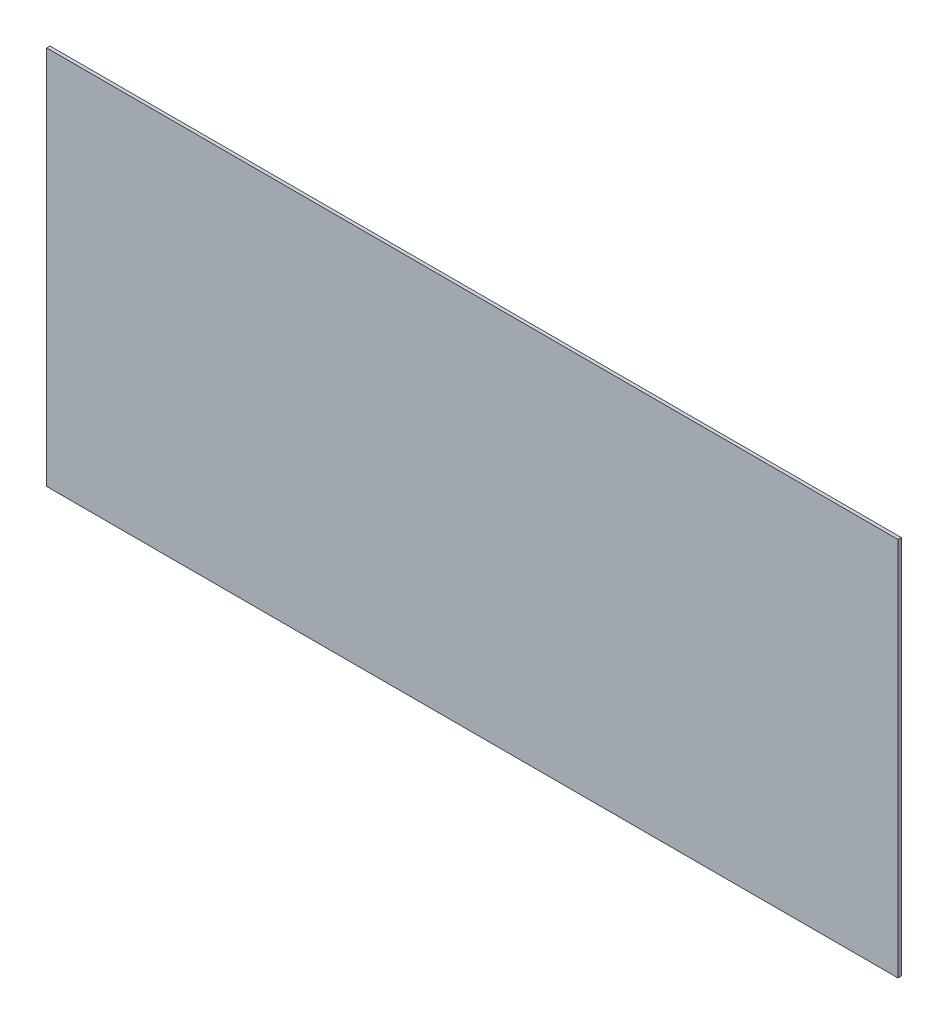
ISO-10303-21;
HEADER;
FILE_DESCRIPTION(('STEP AP214'),'2;1');
FILE_NAME('part.step','',(''),(''),'','','');
FILE_SCHEMA(('AUTOMOTIVE_DESIGN { 1 0 10303 214 1 1 1 1 }'));
ENDSEC;
DATA;
#1=APPLICATION_CONTEXT('core data for automotive mechanical design processes');
#2=APPLICATION_PROTOCOL_DEFINITION('international standard','automotive_design',2000,#1);
#3=PRODUCT_CONTEXT('',#1,'mechanical');
#4=PRODUCT('Part','Part','',(#3));
#5=PRODUCT_RELATED_PRODUCT_CATEGORY('part','',(#4));
#6=PRODUCT_DEFINITION_FORMATION('','',#4);
#7=PRODUCT_DEFINITION_CONTEXT('part definition',#1,'design');
#8=PRODUCT_DEFINITION('design','',#6,#7);
#9=PRODUCT_DEFINITION_SHAPE('','',#8);
#10=(LENGTH_UNIT() NAMED_UNIT(*) SI_UNIT(.MILLI.,.METRE.));
#11=(NAMED_UNIT(*) PLANE_ANGLE_UNIT() SI_UNIT($,.RADIAN.));
#12=(NAMED_UNIT(*) SI_UNIT($,.STERADIAN.) SOLID_ANGLE_UNIT());
#13=UNCERTAINTY_MEASURE_WITH_UNIT(LENGTH_MEASURE(1.E-05),#10,'distance_accuracy_value','');
#14=(GEOMETRIC_REPRESENTATION_CONTEXT(3) GLOBAL_UNCERTAINTY_ASSIGNED_CONTEXT((#13)) GLOBAL_UNIT_ASSIGNED_CONTEXT((#10,
#11,#12)) REPRESENTATION_CONTEXT('',''));
#15=CARTESIAN_POINT('',(0.,0.,0.));
#16=DIRECTION('',(0.,0.,1.));
#17=DIRECTION('',(1.,0.,0.));
#18=AXIS2_PLACEMENT_3D('',#15,#16,#17);
#19=CARTESIAN_POINT('',(13.,-5.8,0.1));
#20=DIRECTION('',(-1.,0.,0.));
#21=DIRECTION('',(0.,0.,1.));
#22=AXIS2_PLACEMENT_3D('',#19,#20,#21);
#23=PLANE('',#22);
#24=DIRECTION('',(0.,1.,0.));
#25=VECTOR('',#24,1.);
#26=CARTESIAN_POINT('',(13.,-5.8,0.));
#27=LINE('',#26,#25);
#28=CARTESIAN_POINT('',(13.,-5.8,0.));
#29=VERTEX_POINT('',#28);
#30=CARTESIAN_POINT('',(13.,5.8,0.));
#31=VERTEX_POINT('',#30);
#32=EDGE_CURVE('E98',#29,#31,#27,.T.);
#33=ORIENTED_EDGE('',*,*,#32,.T.);
#34=DIRECTION('',(0.,0.,-1.));
#35=VECTOR('',#34,1.);
#36=CARTESIAN_POINT('',(13.,5.8,0.1));
#37=LINE('',#36,#35);
#38=CARTESIAN_POINT('',(13.,5.8,0.1));
#39=VERTEX_POINT('',#38);
#40=EDGE_CURVE('E11',#39,#31,#37,.T.);
#41=ORIENTED_EDGE('',*,*,#40,.F.);
#42=DIRECTION('',(0.,1.,0.));
#43=VECTOR('',#42,1.);
#44=CARTESIAN_POINT('',(13.,-5.8,0.1));
#45=LINE('',#44,#43);
#46=CARTESIAN_POINT('',(13.,-5.8,0.1));
#47=VERTEX_POINT('',#46);
#48=EDGE_CURVE('E86',#47,#39,#45,.T.);
#49=ORIENTED_EDGE('',*,*,#48,.F.);
#50=DIRECTION('',(0.,0.,-1.));
#51=VECTOR('',#50,1.);
#52=CARTESIAN_POINT('',(13.,-5.8,0.1));
#53=LINE('',#52,#51);
#54=EDGE_CURVE('E94',#47,#29,#53,.T.);
#55=ORIENTED_EDGE('',*,*,#54,.T.);
#56=EDGE_LOOP('',(#33,#41,#49,#55));
#57=FACE_BOUND('',#56,.T.);
#58=ADVANCED_FACE('F35',(#57),#23,.F.);
#59=CARTESIAN_POINT('',(-13.,5.8,0.1));
#60=DIRECTION('',(0.,-1.,0.));
#61=DIRECTION('',(0.,0.,-1.));
#62=AXIS2_PLACEMENT_3D('',#59,#60,#61);
#63=PLANE('',#62);
#64=DIRECTION('',(-1.,0.,0.));
#65=VECTOR('',#64,1.);
#66=CARTESIAN_POINT('',(-13.,5.8,0.));
#67=LINE('',#66,#65);
#68=CARTESIAN_POINT('',(-13.,5.8,0.));
#69=VERTEX_POINT('',#68);
#70=EDGE_CURVE('E90',#31,#69,#67,.T.);
#71=ORIENTED_EDGE('',*,*,#70,.T.);
#72=DIRECTION('',(0.,0.,-1.));
#73=VECTOR('',#72,1.);
#74=CARTESIAN_POINT('',(-13.,5.8,0.1));
#75=LINE('',#74,#73);
#76=CARTESIAN_POINT('',(-13.,5.8,0.1));
#77=VERTEX_POINT('',#76);
#78=EDGE_CURVE('E43',#77,#69,#75,.T.);
#79=ORIENTED_EDGE('',*,*,#78,.F.);
#80=DIRECTION('',(-1.,0.,0.));
#81=VECTOR('',#80,1.);
#82=CARTESIAN_POINT('',(-13.,5.8,0.1));
#83=LINE('',#82,#81);
#84=EDGE_CURVE('E81',#39,#77,#83,.T.);
#85=ORIENTED_EDGE('',*,*,#84,.F.);
#86=ORIENTED_EDGE('',*,*,#40,.T.);
#87=EDGE_LOOP('',(#71,#79,#85,#86));
#88=FACE_BOUND('',#87,.T.);
#89=ADVANCED_FACE('F89',(#88),#63,.F.);
#90=CARTESIAN_POINT('',(-13.,-5.8,0.1));
#91=DIRECTION('',(1.,0.,0.));
#92=DIRECTION('',(0.,0.,-1.));
#93=AXIS2_PLACEMENT_3D('',#90,#91,#92);
#94=PLANE('',#93);
#95=DIRECTION('',(0.,-1.,0.));
#96=VECTOR('',#95,1.);
#97=CARTESIAN_POINT('',(-13.,-5.8,0.));
#98=LINE('',#97,#96);
#99=CARTESIAN_POINT('',(-13.,-5.8,0.));
#100=VERTEX_POINT('',#99);
#101=EDGE_CURVE('E68',#69,#100,#98,.T.);
#102=ORIENTED_EDGE('',*,*,#101,.T.);
#103=DIRECTION('',(0.,0.,-1.));
#104=VECTOR('',#103,1.);
#105=CARTESIAN_POINT('',(-13.,-5.8,0.1));
#106=LINE('',#105,#104);
#107=CARTESIAN_POINT('',(-13.,-5.8,0.1));
#108=VERTEX_POINT('',#107);
#109=EDGE_CURVE('E91',#108,#100,#106,.T.);
#110=ORIENTED_EDGE('',*,*,#109,.F.);
#111=DIRECTION('',(0.,-1.,0.));
#112=VECTOR('',#111,1.);
#113=CARTESIAN_POINT('',(-13.,-5.8,0.1));
#114=LINE('',#113,#112);
#115=EDGE_CURVE('E84',#77,#108,#114,.T.);
#116=ORIENTED_EDGE('',*,*,#115,.F.);
#117=ORIENTED_EDGE('',*,*,#78,.T.);
#118=EDGE_LOOP('',(#102,#110,#116,#117));
#119=FACE_BOUND('',#118,.T.);
#120=ADVANCED_FACE('F92',(#119),#94,.F.);
#121=CARTESIAN_POINT('',(-13.,-5.8,0.1));
#122=DIRECTION('',(0.,1.,0.));
#123=DIRECTION('',(0.,0.,1.));
#124=AXIS2_PLACEMENT_3D('',#121,#122,#123);
#125=PLANE('',#124);
#126=DIRECTION('',(1.,0.,0.));
#127=VECTOR('',#126,1.);
#128=CARTESIAN_POINT('',(-13.,-5.8,0.));
#129=LINE('',#128,#127);
#130=EDGE_CURVE('E74',#100,#29,#129,.T.);
#131=ORIENTED_EDGE('',*,*,#130,.T.);
#132=ORIENTED_EDGE('',*,*,#54,.F.);
#133=DIRECTION('',(1.,0.,0.));
#134=VECTOR('',#133,1.);
#135=CARTESIAN_POINT('',(-13.,-5.8,0.1));
#136=LINE('',#135,#134);
#137=EDGE_CURVE('E51',#108,#47,#136,.T.);
#138=ORIENTED_EDGE('',*,*,#137,.F.);
#139=ORIENTED_EDGE('',*,*,#109,.T.);
#140=EDGE_LOOP('',(#131,#132,#138,#139));
#141=FACE_BOUND('',#140,.T.);
#142=ADVANCED_FACE('F105',(#141),#125,.F.);
#143=CARTESIAN_POINT('',(0.,0.,0.1));
#144=DIRECTION('',(0.,0.,-1.));
#145=DIRECTION('',(-1.,0.,0.));
#146=AXIS2_PLACEMENT_3D('',#143,#144,#145);
#147=PLANE('',#146);
#148=ORIENTED_EDGE('',*,*,#48,.T.);
#149=ORIENTED_EDGE('',*,*,#84,.T.);
#150=ORIENTED_EDGE('',*,*,#115,.T.);
#151=ORIENTED_EDGE('',*,*,#137,.T.);
#152=EDGE_LOOP('',(#148,#149,#150,#151));
#153=FACE_BOUND('',#152,.T.);
#154=ADVANCED_FACE('F82',(#153),#147,.F.);
#155=CARTESIAN_POINT('',(0.,0.,0.));
#156=DIRECTION('',(0.,0.,-1.));
#157=DIRECTION('',(-1.,0.,0.));
#158=AXIS2_PLACEMENT_3D('',#155,#156,#157);
#159=PLANE('',#158);
#160=ORIENTED_EDGE('',*,*,#32,.F.);
#161=ORIENTED_EDGE('',*,*,#130,.F.);
#162=ORIENTED_EDGE('',*,*,#101,.F.);
#163=ORIENTED_EDGE('',*,*,#70,.F.);
#164=EDGE_LOOP('',(#160,#161,#162,#163));
#165=FACE_BOUND('',#164,.T.);
#166=ADVANCED_FACE('F108',(#165),#159,.T.);
#167=CLOSED_SHELL('',(#58,#89,#120,#142,#154,#166));
#168=MANIFOLD_SOLID_BREP('B2',#167);
#169=ADVANCED_BREP_SHAPE_REPRESENTATION('',(#18,#168),#14);
#170=SHAPE_DEFINITION_REPRESENTATION(#9,#169);
ENDSEC;
END-ISO-10303-21;
